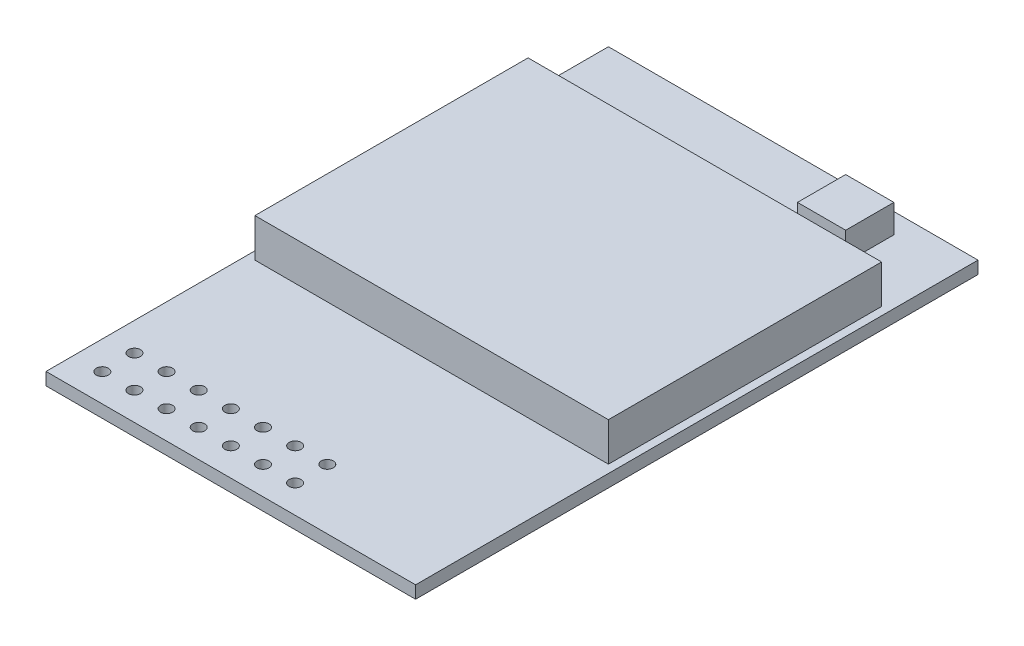
ISO-10303-21;
HEADER;
FILE_DESCRIPTION(('STEP AP214'),'2;1');
FILE_NAME('part.step','',(''),(''),'','','');
FILE_SCHEMA(('AUTOMOTIVE_DESIGN { 1 0 10303 214 1 1 1 1 }'));
ENDSEC;
DATA;
#1=APPLICATION_CONTEXT('core data for automotive mechanical design processes');
#2=APPLICATION_PROTOCOL_DEFINITION('international standard','automotive_design',2000,#1);
#3=PRODUCT_CONTEXT('',#1,'mechanical');
#4=PRODUCT('Part','Part','',(#3));
#5=PRODUCT_RELATED_PRODUCT_CATEGORY('part','',(#4));
#6=PRODUCT_DEFINITION_FORMATION('','',#4);
#7=PRODUCT_DEFINITION_CONTEXT('part definition',#1,'design');
#8=PRODUCT_DEFINITION('design','',#6,#7);
#9=PRODUCT_DEFINITION_SHAPE('','',#8);
#10=(LENGTH_UNIT() NAMED_UNIT(*) SI_UNIT(.MILLI.,.METRE.));
#11=(NAMED_UNIT(*) PLANE_ANGLE_UNIT() SI_UNIT($,.RADIAN.));
#12=(NAMED_UNIT(*) SI_UNIT($,.STERADIAN.) SOLID_ANGLE_UNIT());
#13=UNCERTAINTY_MEASURE_WITH_UNIT(LENGTH_MEASURE(1.E-05),#10,'distance_accuracy_value','');
#14=(GEOMETRIC_REPRESENTATION_CONTEXT(3) GLOBAL_UNCERTAINTY_ASSIGNED_CONTEXT((#13)) GLOBAL_UNIT_ASSIGNED_CONTEXT((#10,
#11,#12)) REPRESENTATION_CONTEXT('',''));
#15=CARTESIAN_POINT('',(0.,0.,0.));
#16=DIRECTION('',(0.,0.,1.));
#17=DIRECTION('',(1.,0.,0.));
#18=AXIS2_PLACEMENT_3D('',#15,#16,#17);
#19=CARTESIAN_POINT('',(0.,0.78,0.));
#20=DIRECTION('',(0.,-1.,0.));
#21=DIRECTION('',(0.,0.,-1.));
#22=AXIS2_PLACEMENT_3D('',#19,#20,#21);
#23=PLANE('',#22);
#24=CARTESIAN_POINT('',(-5.73693796657849,0.78,13.7591055458466));
#25=DIRECTION('',(0.,1.,0.));
#26=DIRECTION('',(0.,0.,1.));
#27=AXIS2_PLACEMENT_3D('',#24,#25,#26);
#28=CIRCLE('',#27,0.375000000000001);
#29=CARTESIAN_POINT('',(-5.73693796657849,0.78,14.1341055458466));
#30=VERTEX_POINT('',#29);
#31=EDGE_CURVE('E547',#30,#30,#28,.T.);
#32=ORIENTED_EDGE('',*,*,#31,.F.);
#33=EDGE_LOOP('',(#32));
#34=FACE_BOUND('',#33,.T.);
#35=CARTESIAN_POINT('',(-7.73693796657849,0.78,13.7591055458466));
#36=DIRECTION('',(0.,1.,0.));
#37=DIRECTION('',(0.,0.,1.));
#38=AXIS2_PLACEMENT_3D('',#35,#36,#37);
#39=CIRCLE('',#38,0.375000000000001);
#40=CARTESIAN_POINT('',(-7.73693796657849,0.78,14.1341055458466));
#41=VERTEX_POINT('',#40);
#42=EDGE_CURVE('E553',#41,#41,#39,.T.);
#43=ORIENTED_EDGE('',*,*,#42,.F.);
#44=EDGE_LOOP('',(#43));
#45=FACE_BOUND('',#44,.T.);
#46=CARTESIAN_POINT('',(2.26306203342152,0.78,15.7591055458466));
#47=DIRECTION('',(0.,1.,0.));
#48=DIRECTION('',(0.,0.,1.));
#49=AXIS2_PLACEMENT_3D('',#46,#47,#48);
#50=CIRCLE('',#49,0.375000000000001);
#51=CARTESIAN_POINT('',(2.26306203342152,0.78,16.1341055458466));
#52=VERTEX_POINT('',#51);
#53=EDGE_CURVE('E630',#52,#52,#50,.T.);
#54=ORIENTED_EDGE('',*,*,#53,.F.);
#55=EDGE_LOOP('',(#54));
#56=FACE_BOUND('',#55,.T.);
#57=CARTESIAN_POINT('',(0.263062033421519,0.78,15.7591055458466));
#58=DIRECTION('',(0.,1.,0.));
#59=DIRECTION('',(0.,0.,1.));
#60=AXIS2_PLACEMENT_3D('',#57,#58,#59);
#61=CIRCLE('',#60,0.375000000000001);
#62=CARTESIAN_POINT('',(0.263062033421519,0.78,16.1341055458466));
#63=VERTEX_POINT('',#62);
#64=EDGE_CURVE('E622',#63,#63,#61,.T.);
#65=ORIENTED_EDGE('',*,*,#64,.F.);
#66=EDGE_LOOP('',(#65));
#67=FACE_BOUND('',#66,.T.);
#68=CARTESIAN_POINT('',(-1.73693796657848,0.78,15.7591055458466));
#69=DIRECTION('',(0.,1.,0.));
#70=DIRECTION('',(0.,0.,1.));
#71=AXIS2_PLACEMENT_3D('',#68,#69,#70);
#72=CIRCLE('',#71,0.375000000000001);
#73=CARTESIAN_POINT('',(-1.73693796657848,0.78,16.1341055458466));
#74=VERTEX_POINT('',#73);
#75=EDGE_CURVE('E589',#74,#74,#72,.T.);
#76=ORIENTED_EDGE('',*,*,#75,.F.);
#77=EDGE_LOOP('',(#76));
#78=FACE_BOUND('',#77,.T.);
#79=CARTESIAN_POINT('',(-3.73693796657848,0.78,15.7591055458466));
#80=DIRECTION('',(0.,1.,0.));
#81=DIRECTION('',(0.,0.,1.));
#82=AXIS2_PLACEMENT_3D('',#79,#80,#81);
#83=CIRCLE('',#82,0.375000000000001);
#84=CARTESIAN_POINT('',(-3.73693796657848,0.78,16.1341055458466));
#85=VERTEX_POINT('',#84);
#86=EDGE_CURVE('E581',#85,#85,#83,.T.);
#87=ORIENTED_EDGE('',*,*,#86,.F.);
#88=EDGE_LOOP('',(#87));
#89=FACE_BOUND('',#88,.T.);
#90=CARTESIAN_POINT('',(-5.73693796657848,0.78,15.7591055458466));
#91=DIRECTION('',(0.,1.,0.));
#92=DIRECTION('',(0.,0.,1.));
#93=AXIS2_PLACEMENT_3D('',#90,#91,#92);
#94=CIRCLE('',#93,0.375000000000001);
#95=CARTESIAN_POINT('',(-5.73693796657848,0.78,16.1341055458466));
#96=VERTEX_POINT('',#95);
#97=EDGE_CURVE('E573',#96,#96,#94,.T.);
#98=ORIENTED_EDGE('',*,*,#97,.F.);
#99=EDGE_LOOP('',(#98));
#100=FACE_BOUND('',#99,.T.);
#101=CARTESIAN_POINT('',(-7.73693796657848,0.78,15.7591055458466));
#102=DIRECTION('',(0.,1.,0.));
#103=DIRECTION('',(0.,0.,1.));
#104=AXIS2_PLACEMENT_3D('',#101,#102,#103);
#105=CIRCLE('',#104,0.375000000000001);
#106=CARTESIAN_POINT('',(-7.73693796657848,0.78,16.1341055458466));
#107=VERTEX_POINT('',#106);
#108=EDGE_CURVE('E565',#107,#107,#105,.T.);
#109=ORIENTED_EDGE('',*,*,#108,.F.);
#110=EDGE_LOOP('',(#109));
#111=FACE_BOUND('',#110,.T.);
#112=CARTESIAN_POINT('',(-3.73693796657849,0.78,13.7591055458466));
#113=DIRECTION('',(0.,1.,0.));
#114=DIRECTION('',(0.,0.,1.));
#115=AXIS2_PLACEMENT_3D('',#112,#113,#114);
#116=CIRCLE('',#115,0.375000000000001);
#117=CARTESIAN_POINT('',(-3.73693796657849,0.78,14.1341055458466));
#118=VERTEX_POINT('',#117);
#119=EDGE_CURVE('E556',#118,#118,#116,.T.);
#120=ORIENTED_EDGE('',*,*,#119,.F.);
#121=EDGE_LOOP('',(#120));
#122=FACE_BOUND('',#121,.T.);
#123=CARTESIAN_POINT('',(-1.73693796657849,0.78,13.7591055458466));
#124=DIRECTION('',(0.,1.,0.));
#125=DIRECTION('',(0.,0.,1.));
#126=AXIS2_PLACEMENT_3D('',#123,#124,#125);
#127=CIRCLE('',#126,0.375000000000001);
#128=CARTESIAN_POINT('',(-1.73693796657849,0.78,14.1341055458466));
#129=VERTEX_POINT('',#128);
#130=EDGE_CURVE('E667',#129,#129,#127,.T.);
#131=ORIENTED_EDGE('',*,*,#130,.F.);
#132=EDGE_LOOP('',(#131));
#133=FACE_BOUND('',#132,.T.);
#134=CARTESIAN_POINT('',(0.263062033421512,0.78,13.7591055458466));
#135=DIRECTION('',(0.,1.,0.));
#136=DIRECTION('',(0.,0.,1.));
#137=AXIS2_PLACEMENT_3D('',#134,#135,#136);
#138=CIRCLE('',#137,0.375000000000001);
#139=CARTESIAN_POINT('',(0.263062033421512,0.78,14.1341055458466));
#140=VERTEX_POINT('',#139);
#141=EDGE_CURVE('E659',#140,#140,#138,.T.);
#142=ORIENTED_EDGE('',*,*,#141,.F.);
#143=EDGE_LOOP('',(#142));
#144=FACE_BOUND('',#143,.T.);
#145=CARTESIAN_POINT('',(2.26306203342151,0.78,13.7591055458466));
#146=DIRECTION('',(0.,1.,0.));
#147=DIRECTION('',(0.,0.,1.));
#148=AXIS2_PLACEMENT_3D('',#145,#146,#147);
#149=CIRCLE('',#148,0.375000000000001);
#150=CARTESIAN_POINT('',(2.26306203342151,0.78,14.1341055458466));
#151=VERTEX_POINT('',#150);
#152=EDGE_CURVE('E651',#151,#151,#149,.T.);
#153=ORIENTED_EDGE('',*,*,#152,.F.);
#154=EDGE_LOOP('',(#153));
#155=FACE_BOUND('',#154,.T.);
#156=CARTESIAN_POINT('',(-9.73693796657849,0.78,13.7591055458466));
#157=DIRECTION('',(0.,1.,0.));
#158=DIRECTION('',(0.,0.,1.));
#159=AXIS2_PLACEMENT_3D('',#156,#157,#158);
#160=CIRCLE('',#159,0.375000000000001);
#161=CARTESIAN_POINT('',(-9.73693796657849,0.78,14.1341055458466));
#162=VERTEX_POINT('',#161);
#163=EDGE_CURVE('E643',#162,#162,#160,.T.);
#164=ORIENTED_EDGE('',*,*,#163,.F.);
#165=EDGE_LOOP('',(#164));
#166=FACE_BOUND('',#165,.T.);
#167=CARTESIAN_POINT('',(-9.73693796657848,0.78,15.7591055458466));
#168=DIRECTION('',(0.,1.,0.));
#169=DIRECTION('',(0.,0.,1.));
#170=AXIS2_PLACEMENT_3D('',#167,#168,#169);
#171=CIRCLE('',#170,0.375000000000001);
#172=CARTESIAN_POINT('',(-9.73693796657848,0.78,16.1341055458466));
#173=VERTEX_POINT('',#172);
#174=EDGE_CURVE('E564',#173,#173,#171,.T.);
#175=ORIENTED_EDGE('',*,*,#174,.F.);
#176=EDGE_LOOP('',(#175));
#177=FACE_BOUND('',#176,.T.);
#178=DIRECTION('',(0.,0.,-1.));
#179=VECTOR('',#178,1.);
#180=CARTESIAN_POINT('',(11.,0.78,-12.));
#181=LINE('',#180,#179);
#182=CARTESIAN_POINT('',(11.,0.78,5.));
#183=VERTEX_POINT('',#182);
#184=CARTESIAN_POINT('',(11.,0.78,-12.));
#185=VERTEX_POINT('',#184);
#186=EDGE_CURVE('E152',#183,#185,#181,.T.);
#187=ORIENTED_EDGE('',*,*,#186,.F.);
#188=DIRECTION('',(1.,0.,0.));
#189=VECTOR('',#188,1.);
#190=CARTESIAN_POINT('',(-11.,0.78,5.));
#191=LINE('',#190,#189);
#192=CARTESIAN_POINT('',(-11.,0.78,5.));
#193=VERTEX_POINT('',#192);
#194=EDGE_CURVE('E168',#193,#183,#191,.T.);
#195=ORIENTED_EDGE('',*,*,#194,.F.);
#196=DIRECTION('',(0.,0.,1.));
#197=VECTOR('',#196,1.);
#198=CARTESIAN_POINT('',(-11.,0.78,-12.));
#199=LINE('',#198,#197);
#200=CARTESIAN_POINT('',(-11.,0.78,-12.));
#201=VERTEX_POINT('',#200);
#202=EDGE_CURVE('E181',#201,#193,#199,.T.);
#203=ORIENTED_EDGE('',*,*,#202,.F.);
#204=DIRECTION('',(-1.,0.,0.));
#205=VECTOR('',#204,1.);
#206=CARTESIAN_POINT('',(-11.,0.78,-12.));
#207=LINE('',#206,#205);
#208=EDGE_CURVE('E157',#185,#201,#207,.T.);
#209=ORIENTED_EDGE('',*,*,#208,.F.);
#210=EDGE_LOOP('',(#187,#195,#203,#209));
#211=FACE_BOUND('',#210,.T.);
#212=DIRECTION('',(0.,0.,-1.));
#213=VECTOR('',#212,1.);
#214=CARTESIAN_POINT('',(11.5,0.78,17.5));
#215=LINE('',#214,#213);
#216=CARTESIAN_POINT('',(11.5,0.78,17.5));
#217=VERTEX_POINT('',#216);
#218=CARTESIAN_POINT('',(11.5,0.78,-17.5));
#219=VERTEX_POINT('',#218);
#220=EDGE_CURVE('E204',#217,#219,#215,.T.);
#221=ORIENTED_EDGE('',*,*,#220,.T.);
#222=DIRECTION('',(-1.,0.,0.));
#223=VECTOR('',#222,1.);
#224=CARTESIAN_POINT('',(-11.5,0.78,-17.5));
#225=LINE('',#224,#223);
#226=CARTESIAN_POINT('',(-11.5,0.78,-17.5));
#227=VERTEX_POINT('',#226);
#228=EDGE_CURVE('E208',#219,#227,#225,.T.);
#229=ORIENTED_EDGE('',*,*,#228,.T.);
#230=DIRECTION('',(0.,0.,1.));
#231=VECTOR('',#230,1.);
#232=CARTESIAN_POINT('',(-11.5,0.78,17.5));
#233=LINE('',#232,#231);
#234=CARTESIAN_POINT('',(-11.5,0.78,17.5));
#235=VERTEX_POINT('',#234);
#236=EDGE_CURVE('E212',#227,#235,#233,.T.);
#237=ORIENTED_EDGE('',*,*,#236,.T.);
#238=DIRECTION('',(1.,0.,0.));
#239=VECTOR('',#238,1.);
#240=CARTESIAN_POINT('',(-11.5,0.78,17.5));
#241=LINE('',#240,#239);
#242=EDGE_CURVE('E215',#235,#217,#241,.T.);
#243=ORIENTED_EDGE('',*,*,#242,.T.);
#244=EDGE_LOOP('',(#221,#229,#237,#243));
#245=FACE_BOUND('',#244,.T.);
#246=DIRECTION('',(0.,0.,-1.));
#247=VECTOR('',#246,1.);
#248=CARTESIAN_POINT('',(7.52134132497843,0.78,-16.2441492984607));
#249=LINE('',#248,#247);
#250=CARTESIAN_POINT('',(7.52134132497843,0.78,-13.2441492984607));
#251=VERTEX_POINT('',#250);
#252=CARTESIAN_POINT('',(7.52134132497843,0.78,-16.2441492984607));
#253=VERTEX_POINT('',#252);
#254=EDGE_CURVE('E150',#251,#253,#249,.T.);
#255=ORIENTED_EDGE('',*,*,#254,.F.);
#256=DIRECTION('',(1.,0.,0.));
#257=VECTOR('',#256,1.);
#258=CARTESIAN_POINT('',(4.52134132497843,0.78,-13.2441492984607));
#259=LINE('',#258,#257);
#260=CARTESIAN_POINT('',(4.52134132497843,0.78,-13.2441492984607));
#261=VERTEX_POINT('',#260);
#262=EDGE_CURVE('E147',#261,#251,#259,.T.);
#263=ORIENTED_EDGE('',*,*,#262,.F.);
#264=DIRECTION('',(0.,0.,1.));
#265=VECTOR('',#264,1.);
#266=CARTESIAN_POINT('',(4.52134132497843,0.78,-16.2441492984607));
#267=LINE('',#266,#265);
#268=CARTESIAN_POINT('',(4.52134132497843,0.78,-16.2441492984607));
#269=VERTEX_POINT('',#268);
#270=EDGE_CURVE('E59',#269,#261,#267,.T.);
#271=ORIENTED_EDGE('',*,*,#270,.F.);
#272=DIRECTION('',(-1.,0.,0.));
#273=VECTOR('',#272,1.);
#274=CARTESIAN_POINT('',(4.52134132497843,0.78,-16.2441492984607));
#275=LINE('',#274,#273);
#276=EDGE_CURVE('E54',#253,#269,#275,.T.);
#277=ORIENTED_EDGE('',*,*,#276,.F.);
#278=EDGE_LOOP('',(#255,#263,#271,#277));
#279=FACE_BOUND('',#278,.T.);
#280=ADVANCED_FACE('F38',(#34,#45,#56,#67,#78,#89,#100,#111,#122,#133,#144,#155,#166,#177,#211,
#245,#279),#23,.F.);
#281=CARTESIAN_POINT('',(11.5,0.78,17.5));
#282=DIRECTION('',(-1.,0.,0.));
#283=DIRECTION('',(0.,0.,1.));
#284=AXIS2_PLACEMENT_3D('',#281,#282,#283);
#285=PLANE('',#284);
#286=DIRECTION('',(0.,0.,-1.));
#287=VECTOR('',#286,1.);
#288=CARTESIAN_POINT('',(11.5,0.,17.5));
#289=LINE('',#288,#287);
#290=CARTESIAN_POINT('',(11.5,0.,17.5));
#291=VERTEX_POINT('',#290);
#292=CARTESIAN_POINT('',(11.5,0.,-17.5));
#293=VERTEX_POINT('',#292);
#294=EDGE_CURVE('E203',#291,#293,#289,.T.);
#295=ORIENTED_EDGE('',*,*,#294,.T.);
#296=DIRECTION('',(0.,-1.,0.));
#297=VECTOR('',#296,1.);
#298=CARTESIAN_POINT('',(11.5,0.78,-17.5));
#299=LINE('',#298,#297);
#300=EDGE_CURVE('E11',#219,#293,#299,.T.);
#301=ORIENTED_EDGE('',*,*,#300,.F.);
#302=ORIENTED_EDGE('',*,*,#220,.F.);
#303=DIRECTION('',(0.,-1.,0.));
#304=VECTOR('',#303,1.);
#305=CARTESIAN_POINT('',(11.5,0.78,17.5));
#306=LINE('',#305,#304);
#307=EDGE_CURVE('E218',#217,#291,#306,.T.);
#308=ORIENTED_EDGE('',*,*,#307,.T.);
#309=EDGE_LOOP('',(#295,#301,#302,#308));
#310=FACE_BOUND('',#309,.T.);
#311=ADVANCED_FACE('F40',(#310),#285,.F.);
#312=CARTESIAN_POINT('',(-11.5,0.78,-17.5));
#313=DIRECTION('',(0.,0.,1.));
#314=DIRECTION('',(1.,0.,0.));
#315=AXIS2_PLACEMENT_3D('',#312,#313,#314);
#316=PLANE('',#315);
#317=DIRECTION('',(-1.,0.,0.));
#318=VECTOR('',#317,1.);
#319=CARTESIAN_POINT('',(-11.5,0.,-17.5));
#320=LINE('',#319,#318);
#321=CARTESIAN_POINT('',(-11.5,0.,-17.5));
#322=VERTEX_POINT('',#321);
#323=EDGE_CURVE('E222',#293,#322,#320,.T.);
#324=ORIENTED_EDGE('',*,*,#323,.T.);
#325=DIRECTION('',(0.,-1.,0.));
#326=VECTOR('',#325,1.);
#327=CARTESIAN_POINT('',(-11.5,0.78,-17.5));
#328=LINE('',#327,#326);
#329=EDGE_CURVE('E47',#227,#322,#328,.T.);
#330=ORIENTED_EDGE('',*,*,#329,.F.);
#331=ORIENTED_EDGE('',*,*,#228,.F.);
#332=ORIENTED_EDGE('',*,*,#300,.T.);
#333=EDGE_LOOP('',(#324,#330,#331,#332));
#334=FACE_BOUND('',#333,.T.);
#335=ADVANCED_FACE('F257',(#334),#316,.F.);
#336=CARTESIAN_POINT('',(-11.5,0.78,17.5));
#337=DIRECTION('',(1.,0.,0.));
#338=DIRECTION('',(0.,0.,-1.));
#339=AXIS2_PLACEMENT_3D('',#336,#337,#338);
#340=PLANE('',#339);
#341=DIRECTION('',(0.,0.,1.));
#342=VECTOR('',#341,1.);
#343=CARTESIAN_POINT('',(-11.5,0.,17.5));
#344=LINE('',#343,#342);
#345=CARTESIAN_POINT('',(-11.5,0.,17.5));
#346=VERTEX_POINT('',#345);
#347=EDGE_CURVE('E225',#322,#346,#344,.T.);
#348=ORIENTED_EDGE('',*,*,#347,.T.);
#349=DIRECTION('',(0.,-1.,0.));
#350=VECTOR('',#349,1.);
#351=CARTESIAN_POINT('',(-11.5,0.78,17.5));
#352=LINE('',#351,#350);
#353=EDGE_CURVE('E233',#235,#346,#352,.T.);
#354=ORIENTED_EDGE('',*,*,#353,.F.);
#355=ORIENTED_EDGE('',*,*,#236,.F.);
#356=ORIENTED_EDGE('',*,*,#329,.T.);
#357=EDGE_LOOP('',(#348,#354,#355,#356));
#358=FACE_BOUND('',#357,.T.);
#359=ADVANCED_FACE('F242',(#358),#340,.F.);
#360=CARTESIAN_POINT('',(-11.5,0.78,17.5));
#361=DIRECTION('',(0.,0.,-1.));
#362=DIRECTION('',(-1.,0.,0.));
#363=AXIS2_PLACEMENT_3D('',#360,#361,#362);
#364=PLANE('',#363);
#365=DIRECTION('',(1.,0.,0.));
#366=VECTOR('',#365,1.);
#367=CARTESIAN_POINT('',(-11.5,0.,17.5));
#368=LINE('',#367,#366);
#369=EDGE_CURVE('E209',#346,#291,#368,.T.);
#370=ORIENTED_EDGE('',*,*,#369,.T.);
#371=ORIENTED_EDGE('',*,*,#307,.F.);
#372=ORIENTED_EDGE('',*,*,#242,.F.);
#373=ORIENTED_EDGE('',*,*,#353,.T.);
#374=EDGE_LOOP('',(#370,#371,#372,#373));
#375=FACE_BOUND('',#374,.T.);
#376=ADVANCED_FACE('F251',(#375),#364,.F.);
#377=CARTESIAN_POINT('',(0.,0.,0.));
#378=DIRECTION('',(0.,-1.,0.));
#379=DIRECTION('',(0.,0.,-1.));
#380=AXIS2_PLACEMENT_3D('',#377,#378,#379);
#381=PLANE('',#380);
#382=CARTESIAN_POINT('',(-5.73693796657849,0.,13.7591055458466));
#383=DIRECTION('',(0.,1.,0.));
#384=DIRECTION('',(0.,0.,1.));
#385=AXIS2_PLACEMENT_3D('',#382,#383,#384);
#386=CIRCLE('',#385,0.375000000000001);
#387=CARTESIAN_POINT('',(-5.73693796657849,0.,14.1341055458466));
#388=VERTEX_POINT('',#387);
#389=EDGE_CURVE('E545',#388,#388,#386,.T.);
#390=ORIENTED_EDGE('',*,*,#389,.T.);
#391=EDGE_LOOP('',(#390));
#392=FACE_BOUND('',#391,.T.);
#393=CARTESIAN_POINT('',(-7.73693796657849,0.,13.7591055458466));
#394=DIRECTION('',(0.,1.,0.));
#395=DIRECTION('',(0.,0.,1.));
#396=AXIS2_PLACEMENT_3D('',#393,#394,#395);
#397=CIRCLE('',#396,0.375000000000001);
#398=CARTESIAN_POINT('',(-7.73693796657849,0.,14.1341055458466));
#399=VERTEX_POINT('',#398);
#400=EDGE_CURVE('E634',#399,#399,#397,.T.);
#401=ORIENTED_EDGE('',*,*,#400,.T.);
#402=EDGE_LOOP('',(#401));
#403=FACE_BOUND('',#402,.T.);
#404=CARTESIAN_POINT('',(2.26306203342152,0.,15.7591055458466));
#405=DIRECTION('',(0.,1.,0.));
#406=DIRECTION('',(0.,0.,1.));
#407=AXIS2_PLACEMENT_3D('',#404,#405,#406);
#408=CIRCLE('',#407,0.375000000000001);
#409=CARTESIAN_POINT('',(2.26306203342152,0.,16.1341055458466));
#410=VERTEX_POINT('',#409);
#411=EDGE_CURVE('E626',#410,#410,#408,.T.);
#412=ORIENTED_EDGE('',*,*,#411,.T.);
#413=EDGE_LOOP('',(#412));
#414=FACE_BOUND('',#413,.T.);
#415=CARTESIAN_POINT('',(0.263062033421519,0.,15.7591055458466));
#416=DIRECTION('',(0.,1.,0.));
#417=DIRECTION('',(0.,0.,1.));
#418=AXIS2_PLACEMENT_3D('',#415,#416,#417);
#419=CIRCLE('',#418,0.375000000000001);
#420=CARTESIAN_POINT('',(0.263062033421519,0.,16.1341055458466));
#421=VERTEX_POINT('',#420);
#422=EDGE_CURVE('E593',#421,#421,#419,.T.);
#423=ORIENTED_EDGE('',*,*,#422,.T.);
#424=EDGE_LOOP('',(#423));
#425=FACE_BOUND('',#424,.T.);
#426=CARTESIAN_POINT('',(-1.73693796657848,0.,15.7591055458466));
#427=DIRECTION('',(0.,1.,0.));
#428=DIRECTION('',(0.,0.,1.));
#429=AXIS2_PLACEMENT_3D('',#426,#427,#428);
#430=CIRCLE('',#429,0.375000000000001);
#431=CARTESIAN_POINT('',(-1.73693796657848,0.,16.1341055458466));
#432=VERTEX_POINT('',#431);
#433=EDGE_CURVE('E585',#432,#432,#430,.T.);
#434=ORIENTED_EDGE('',*,*,#433,.T.);
#435=EDGE_LOOP('',(#434));
#436=FACE_BOUND('',#435,.T.);
#437=CARTESIAN_POINT('',(-3.73693796657848,0.,15.7591055458466));
#438=DIRECTION('',(0.,1.,0.));
#439=DIRECTION('',(0.,0.,1.));
#440=AXIS2_PLACEMENT_3D('',#437,#438,#439);
#441=CIRCLE('',#440,0.375000000000001);
#442=CARTESIAN_POINT('',(-3.73693796657848,0.,16.1341055458466));
#443=VERTEX_POINT('',#442);
#444=EDGE_CURVE('E577',#443,#443,#441,.T.);
#445=ORIENTED_EDGE('',*,*,#444,.T.);
#446=EDGE_LOOP('',(#445));
#447=FACE_BOUND('',#446,.T.);
#448=CARTESIAN_POINT('',(-5.73693796657848,0.,15.7591055458466));
#449=DIRECTION('',(0.,1.,0.));
#450=DIRECTION('',(0.,0.,1.));
#451=AXIS2_PLACEMENT_3D('',#448,#449,#450);
#452=CIRCLE('',#451,0.375000000000001);
#453=CARTESIAN_POINT('',(-5.73693796657848,0.,16.1341055458466));
#454=VERTEX_POINT('',#453);
#455=EDGE_CURVE('E569',#454,#454,#452,.T.);
#456=ORIENTED_EDGE('',*,*,#455,.T.);
#457=EDGE_LOOP('',(#456));
#458=FACE_BOUND('',#457,.T.);
#459=CARTESIAN_POINT('',(-7.73693796657848,0.,15.7591055458466));
#460=DIRECTION('',(0.,1.,0.));
#461=DIRECTION('',(0.,0.,1.));
#462=AXIS2_PLACEMENT_3D('',#459,#460,#461);
#463=CIRCLE('',#462,0.375000000000001);
#464=CARTESIAN_POINT('',(-7.73693796657848,0.,16.1341055458466));
#465=VERTEX_POINT('',#464);
#466=EDGE_CURVE('E560',#465,#465,#463,.T.);
#467=ORIENTED_EDGE('',*,*,#466,.T.);
#468=EDGE_LOOP('',(#467));
#469=FACE_BOUND('',#468,.T.);
#470=CARTESIAN_POINT('',(-3.73693796657849,0.,13.7591055458466));
#471=DIRECTION('',(0.,1.,0.));
#472=DIRECTION('',(0.,0.,1.));
#473=AXIS2_PLACEMENT_3D('',#470,#471,#472);
#474=CIRCLE('',#473,0.375000000000001);
#475=CARTESIAN_POINT('',(-3.73693796657849,0.,14.1341055458466));
#476=VERTEX_POINT('',#475);
#477=EDGE_CURVE('E549',#476,#476,#474,.T.);
#478=ORIENTED_EDGE('',*,*,#477,.T.);
#479=EDGE_LOOP('',(#478));
#480=FACE_BOUND('',#479,.T.);
#481=CARTESIAN_POINT('',(-1.73693796657849,0.,13.7591055458466));
#482=DIRECTION('',(0.,1.,0.));
#483=DIRECTION('',(0.,0.,1.));
#484=AXIS2_PLACEMENT_3D('',#481,#482,#483);
#485=CIRCLE('',#484,0.375000000000001);
#486=CARTESIAN_POINT('',(-1.73693796657849,0.,14.1341055458466));
#487=VERTEX_POINT('',#486);
#488=EDGE_CURVE('E671',#487,#487,#485,.T.);
#489=ORIENTED_EDGE('',*,*,#488,.T.);
#490=EDGE_LOOP('',(#489));
#491=FACE_BOUND('',#490,.T.);
#492=CARTESIAN_POINT('',(0.263062033421512,0.,13.7591055458466));
#493=DIRECTION('',(0.,1.,0.));
#494=DIRECTION('',(0.,0.,1.));
#495=AXIS2_PLACEMENT_3D('',#492,#493,#494);
#496=CIRCLE('',#495,0.375000000000001);
#497=CARTESIAN_POINT('',(0.263062033421512,0.,14.1341055458466));
#498=VERTEX_POINT('',#497);
#499=EDGE_CURVE('E663',#498,#498,#496,.T.);
#500=ORIENTED_EDGE('',*,*,#499,.T.);
#501=EDGE_LOOP('',(#500));
#502=FACE_BOUND('',#501,.T.);
#503=CARTESIAN_POINT('',(2.26306203342151,0.,13.7591055458466));
#504=DIRECTION('',(0.,1.,0.));
#505=DIRECTION('',(0.,0.,1.));
#506=AXIS2_PLACEMENT_3D('',#503,#504,#505);
#507=CIRCLE('',#506,0.375000000000001);
#508=CARTESIAN_POINT('',(2.26306203342151,0.,14.1341055458466));
#509=VERTEX_POINT('',#508);
#510=EDGE_CURVE('E655',#509,#509,#507,.T.);
#511=ORIENTED_EDGE('',*,*,#510,.T.);
#512=EDGE_LOOP('',(#511));
#513=FACE_BOUND('',#512,.T.);
#514=CARTESIAN_POINT('',(-9.73693796657849,0.,13.7591055458466));
#515=DIRECTION('',(0.,1.,0.));
#516=DIRECTION('',(0.,0.,1.));
#517=AXIS2_PLACEMENT_3D('',#514,#515,#516);
#518=CIRCLE('',#517,0.375000000000001);
#519=CARTESIAN_POINT('',(-9.73693796657849,0.,14.1341055458466));
#520=VERTEX_POINT('',#519);
#521=EDGE_CURVE('E647',#520,#520,#518,.T.);
#522=ORIENTED_EDGE('',*,*,#521,.T.);
#523=EDGE_LOOP('',(#522));
#524=FACE_BOUND('',#523,.T.);
#525=CARTESIAN_POINT('',(-9.73693796657848,0.,15.7591055458466));
#526=DIRECTION('',(0.,1.,0.));
#527=DIRECTION('',(0.,0.,1.));
#528=AXIS2_PLACEMENT_3D('',#525,#526,#527);
#529=CIRCLE('',#528,0.375000000000001);
#530=CARTESIAN_POINT('',(-9.73693796657848,0.,16.1341055458466));
#531=VERTEX_POINT('',#530);
#532=EDGE_CURVE('E594',#531,#531,#529,.T.);
#533=ORIENTED_EDGE('',*,*,#532,.T.);
#534=EDGE_LOOP('',(#533));
#535=FACE_BOUND('',#534,.T.);
#536=ORIENTED_EDGE('',*,*,#294,.F.);
#537=ORIENTED_EDGE('',*,*,#369,.F.);
#538=ORIENTED_EDGE('',*,*,#347,.F.);
#539=ORIENTED_EDGE('',*,*,#323,.F.);
#540=EDGE_LOOP('',(#536,#537,#538,#539));
#541=FACE_BOUND('',#540,.T.);
#542=ADVANCED_FACE('F248',(#392,#403,#414,#425,#436,#447,#458,#469,#480,#491,#502,#513,#524,
#535,#541),#381,.T.);
#543=CARTESIAN_POINT('',(11.,3.18,-12.));
#544=DIRECTION('',(-1.,0.,0.));
#545=DIRECTION('',(0.,0.,1.));
#546=AXIS2_PLACEMENT_3D('',#543,#544,#545);
#547=PLANE('',#546);
#548=ORIENTED_EDGE('',*,*,#186,.T.);
#549=DIRECTION('',(0.,-1.,0.));
#550=VECTOR('',#549,1.);
#551=CARTESIAN_POINT('',(11.,3.18,-12.));
#552=LINE('',#551,#550);
#553=CARTESIAN_POINT('',(11.,3.18,-12.));
#554=VERTEX_POINT('',#553);
#555=EDGE_CURVE('E199',#554,#185,#552,.T.);
#556=ORIENTED_EDGE('',*,*,#555,.F.);
#557=DIRECTION('',(0.,0.,-1.));
#558=VECTOR('',#557,1.);
#559=CARTESIAN_POINT('',(11.,3.18,-12.));
#560=LINE('',#559,#558);
#561=CARTESIAN_POINT('',(11.,3.18,5.));
#562=VERTEX_POINT('',#561);
#563=EDGE_CURVE('E163',#562,#554,#560,.T.);
#564=ORIENTED_EDGE('',*,*,#563,.F.);
#565=DIRECTION('',(0.,-1.,0.));
#566=VECTOR('',#565,1.);
#567=CARTESIAN_POINT('',(11.,3.18,5.));
#568=LINE('',#567,#566);
#569=EDGE_CURVE('E176',#562,#183,#568,.T.);
#570=ORIENTED_EDGE('',*,*,#569,.T.);
#571=EDGE_LOOP('',(#548,#556,#564,#570));
#572=FACE_BOUND('',#571,.T.);
#573=ADVANCED_FACE('F273',(#572),#547,.F.);
#574=CARTESIAN_POINT('',(-11.,3.18,-12.));
#575=DIRECTION('',(0.,0.,1.));
#576=DIRECTION('',(1.,0.,0.));
#577=AXIS2_PLACEMENT_3D('',#574,#575,#576);
#578=PLANE('',#577);
#579=ORIENTED_EDGE('',*,*,#208,.T.);
#580=DIRECTION('',(0.,-1.,0.));
#581=VECTOR('',#580,1.);
#582=CARTESIAN_POINT('',(-11.,3.18,-12.));
#583=LINE('',#582,#581);
#584=CARTESIAN_POINT('',(-11.,3.18,-12.));
#585=VERTEX_POINT('',#584);
#586=EDGE_CURVE('E195',#585,#201,#583,.T.);
#587=ORIENTED_EDGE('',*,*,#586,.F.);
#588=DIRECTION('',(-1.,0.,0.));
#589=VECTOR('',#588,1.);
#590=CARTESIAN_POINT('',(-11.,3.18,-12.));
#591=LINE('',#590,#589);
#592=EDGE_CURVE('E167',#554,#585,#591,.T.);
#593=ORIENTED_EDGE('',*,*,#592,.F.);
#594=ORIENTED_EDGE('',*,*,#555,.T.);
#595=EDGE_LOOP('',(#579,#587,#593,#594));
#596=FACE_BOUND('',#595,.T.);
#597=ADVANCED_FACE('F294',(#596),#578,.F.);
#598=CARTESIAN_POINT('',(-11.,3.18,-12.));
#599=DIRECTION('',(1.,0.,0.));
#600=DIRECTION('',(0.,0.,-1.));
#601=AXIS2_PLACEMENT_3D('',#598,#599,#600);
#602=PLANE('',#601);
#603=ORIENTED_EDGE('',*,*,#202,.T.);
#604=DIRECTION('',(0.,-1.,0.));
#605=VECTOR('',#604,1.);
#606=CARTESIAN_POINT('',(-11.,3.18,5.));
#607=LINE('',#606,#605);
#608=CARTESIAN_POINT('',(-11.,3.18,5.));
#609=VERTEX_POINT('',#608);
#610=EDGE_CURVE('E191',#609,#193,#607,.T.);
#611=ORIENTED_EDGE('',*,*,#610,.F.);
#612=DIRECTION('',(0.,0.,1.));
#613=VECTOR('',#612,1.);
#614=CARTESIAN_POINT('',(-11.,3.18,-12.));
#615=LINE('',#614,#613);
#616=EDGE_CURVE('E171',#585,#609,#615,.T.);
#617=ORIENTED_EDGE('',*,*,#616,.F.);
#618=ORIENTED_EDGE('',*,*,#586,.T.);
#619=EDGE_LOOP('',(#603,#611,#617,#618));
#620=FACE_BOUND('',#619,.T.);
#621=ADVANCED_FACE('F301',(#620),#602,.F.);
#622=CARTESIAN_POINT('',(-11.,3.18,5.));
#623=DIRECTION('',(0.,0.,-1.));
#624=DIRECTION('',(-1.,0.,0.));
#625=AXIS2_PLACEMENT_3D('',#622,#623,#624);
#626=PLANE('',#625);
#627=ORIENTED_EDGE('',*,*,#194,.T.);
#628=ORIENTED_EDGE('',*,*,#569,.F.);
#629=DIRECTION('',(1.,0.,0.));
#630=VECTOR('',#629,1.);
#631=CARTESIAN_POINT('',(-11.,3.18,5.));
#632=LINE('',#631,#630);
#633=EDGE_CURVE('E174',#609,#562,#632,.T.);
#634=ORIENTED_EDGE('',*,*,#633,.F.);
#635=ORIENTED_EDGE('',*,*,#610,.T.);
#636=EDGE_LOOP('',(#627,#628,#634,#635));
#637=FACE_BOUND('',#636,.T.);
#638=ADVANCED_FACE('F308',(#637),#626,.F.);
#639=CARTESIAN_POINT('',(0.,3.18,0.));
#640=DIRECTION('',(0.,1.,0.));
#641=DIRECTION('',(0.,0.,1.));
#642=AXIS2_PLACEMENT_3D('',#639,#640,#641);
#643=PLANE('',#642);
#644=ORIENTED_EDGE('',*,*,#563,.T.);
#645=ORIENTED_EDGE('',*,*,#592,.T.);
#646=ORIENTED_EDGE('',*,*,#616,.T.);
#647=ORIENTED_EDGE('',*,*,#633,.T.);
#648=EDGE_LOOP('',(#644,#645,#646,#647));
#649=FACE_BOUND('',#648,.T.);
#650=ADVANCED_FACE('F316',(#649),#643,.T.);
#651=CARTESIAN_POINT('',(7.52134132497843,2.53,-16.2441492984607));
#652=DIRECTION('',(-1.,0.,0.));
#653=DIRECTION('',(0.,0.,1.));
#654=AXIS2_PLACEMENT_3D('',#651,#652,#653);
#655=PLANE('',#654);
#656=ORIENTED_EDGE('',*,*,#254,.T.);
#657=DIRECTION('',(0.,-1.,0.));
#658=VECTOR('',#657,1.);
#659=CARTESIAN_POINT('',(7.52134132497843,2.53,-16.2441492984607));
#660=LINE('',#659,#658);
#661=CARTESIAN_POINT('',(7.52134132497843,2.53,-16.2441492984607));
#662=VERTEX_POINT('',#661);
#663=EDGE_CURVE('E129',#662,#253,#660,.T.);
#664=ORIENTED_EDGE('',*,*,#663,.F.);
#665=DIRECTION('',(0.,0.,-1.));
#666=VECTOR('',#665,1.);
#667=CARTESIAN_POINT('',(7.52134132497843,2.53,-16.2441492984607));
#668=LINE('',#667,#666);
#669=CARTESIAN_POINT('',(7.52134132497843,2.53,-13.2441492984607));
#670=VERTEX_POINT('',#669);
#671=EDGE_CURVE('E137',#670,#662,#668,.T.);
#672=ORIENTED_EDGE('',*,*,#671,.F.);
#673=DIRECTION('',(0.,-1.,0.));
#674=VECTOR('',#673,1.);
#675=CARTESIAN_POINT('',(7.52134132497843,2.53,-13.2441492984607));
#676=LINE('',#675,#674);
#677=EDGE_CURVE('E605',#670,#251,#676,.T.);
#678=ORIENTED_EDGE('',*,*,#677,.T.);
#679=EDGE_LOOP('',(#656,#664,#672,#678));
#680=FACE_BOUND('',#679,.T.);
#681=ADVANCED_FACE('F149',(#680),#655,.F.);
#682=CARTESIAN_POINT('',(4.52134132497843,2.53,-16.2441492984607));
#683=DIRECTION('',(0.,0.,1.));
#684=DIRECTION('',(1.,0.,0.));
#685=AXIS2_PLACEMENT_3D('',#682,#683,#684);
#686=PLANE('',#685);
#687=ORIENTED_EDGE('',*,*,#276,.T.);
#688=DIRECTION('',(0.,-1.,0.));
#689=VECTOR('',#688,1.);
#690=CARTESIAN_POINT('',(4.52134132497843,2.53,-16.2441492984607));
#691=LINE('',#690,#689);
#692=CARTESIAN_POINT('',(4.52134132497843,2.53,-16.2441492984607));
#693=VERTEX_POINT('',#692);
#694=EDGE_CURVE('E132',#693,#269,#691,.T.);
#695=ORIENTED_EDGE('',*,*,#694,.F.);
#696=DIRECTION('',(-1.,0.,0.));
#697=VECTOR('',#696,1.);
#698=CARTESIAN_POINT('',(4.52134132497843,2.53,-16.2441492984607));
#699=LINE('',#698,#697);
#700=EDGE_CURVE('E125',#662,#693,#699,.T.);
#701=ORIENTED_EDGE('',*,*,#700,.F.);
#702=ORIENTED_EDGE('',*,*,#663,.T.);
#703=EDGE_LOOP('',(#687,#695,#701,#702));
#704=FACE_BOUND('',#703,.T.);
#705=ADVANCED_FACE('F127',(#704),#686,.F.);
#706=CARTESIAN_POINT('',(4.52134132497843,2.53,-16.2441492984607));
#707=DIRECTION('',(1.,0.,0.));
#708=DIRECTION('',(0.,0.,-1.));
#709=AXIS2_PLACEMENT_3D('',#706,#707,#708);
#710=PLANE('',#709);
#711=ORIENTED_EDGE('',*,*,#270,.T.);
#712=DIRECTION('',(0.,-1.,0.));
#713=VECTOR('',#712,1.);
#714=CARTESIAN_POINT('',(4.52134132497843,2.53,-13.2441492984607));
#715=LINE('',#714,#713);
#716=CARTESIAN_POINT('',(4.52134132497843,2.53,-13.2441492984607));
#717=VERTEX_POINT('',#716);
#718=EDGE_CURVE('E159',#717,#261,#715,.T.);
#719=ORIENTED_EDGE('',*,*,#718,.F.);
#720=DIRECTION('',(0.,0.,1.));
#721=VECTOR('',#720,1.);
#722=CARTESIAN_POINT('',(4.52134132497843,2.53,-16.2441492984607));
#723=LINE('',#722,#721);
#724=EDGE_CURVE('E136',#693,#717,#723,.T.);
#725=ORIENTED_EDGE('',*,*,#724,.F.);
#726=ORIENTED_EDGE('',*,*,#694,.T.);
#727=EDGE_LOOP('',(#711,#719,#725,#726));
#728=FACE_BOUND('',#727,.T.);
#729=ADVANCED_FACE('F337',(#728),#710,.F.);
#730=CARTESIAN_POINT('',(4.52134132497843,2.53,-13.2441492984607));
#731=DIRECTION('',(0.,0.,-1.));
#732=DIRECTION('',(-1.,0.,0.));
#733=AXIS2_PLACEMENT_3D('',#730,#731,#732);
#734=PLANE('',#733);
#735=ORIENTED_EDGE('',*,*,#262,.T.);
#736=ORIENTED_EDGE('',*,*,#677,.F.);
#737=DIRECTION('',(1.,0.,0.));
#738=VECTOR('',#737,1.);
#739=CARTESIAN_POINT('',(4.52134132497843,2.53,-13.2441492984607));
#740=LINE('',#739,#738);
#741=EDGE_CURVE('E142',#717,#670,#740,.T.);
#742=ORIENTED_EDGE('',*,*,#741,.F.);
#743=ORIENTED_EDGE('',*,*,#718,.T.);
#744=EDGE_LOOP('',(#735,#736,#742,#743));
#745=FACE_BOUND('',#744,.T.);
#746=ADVANCED_FACE('F344',(#745),#734,.F.);
#747=CARTESIAN_POINT('',(0.,2.53,0.));
#748=DIRECTION('',(0.,1.,0.));
#749=DIRECTION('',(0.,0.,1.));
#750=AXIS2_PLACEMENT_3D('',#747,#748,#749);
#751=PLANE('',#750);
#752=ORIENTED_EDGE('',*,*,#671,.T.);
#753=ORIENTED_EDGE('',*,*,#700,.T.);
#754=ORIENTED_EDGE('',*,*,#724,.T.);
#755=ORIENTED_EDGE('',*,*,#741,.T.);
#756=EDGE_LOOP('',(#752,#753,#754,#755));
#757=FACE_BOUND('',#756,.T.);
#758=ADVANCED_FACE('F140',(#757),#751,.T.);
#759=CARTESIAN_POINT('',(-9.73693796657848,0.,15.7591055458466));
#760=DIRECTION('',(0.,1.,0.));
#761=DIRECTION('',(0.,0.,1.));
#762=AXIS2_PLACEMENT_3D('',#759,#760,#761);
#763=CYLINDRICAL_SURFACE('',#762,0.375000000000001);
#764=ORIENTED_EDGE('',*,*,#532,.F.);
#765=EDGE_LOOP('',(#764));
#766=FACE_BOUND('',#765,.T.);
#767=ORIENTED_EDGE('',*,*,#174,.T.);
#768=EDGE_LOOP('',(#767));
#769=FACE_BOUND('',#768,.T.);
#770=ADVANCED_FACE('F359',(#766,#769),#763,.F.);
#771=CARTESIAN_POINT('',(-9.73693796657849,0.,13.7591055458466));
#772=DIRECTION('',(0.,1.,0.));
#773=DIRECTION('',(0.,0.,1.));
#774=AXIS2_PLACEMENT_3D('',#771,#772,#773);
#775=CYLINDRICAL_SURFACE('',#774,0.375000000000001);
#776=ORIENTED_EDGE('',*,*,#521,.F.);
#777=EDGE_LOOP('',(#776));
#778=FACE_BOUND('',#777,.T.);
#779=ORIENTED_EDGE('',*,*,#163,.T.);
#780=EDGE_LOOP('',(#779));
#781=FACE_BOUND('',#780,.T.);
#782=ADVANCED_FACE('F365',(#778,#781),#775,.F.);
#783=CARTESIAN_POINT('',(2.26306203342151,0.,13.7591055458466));
#784=DIRECTION('',(0.,1.,0.));
#785=DIRECTION('',(0.,0.,1.));
#786=AXIS2_PLACEMENT_3D('',#783,#784,#785);
#787=CYLINDRICAL_SURFACE('',#786,0.375000000000001);
#788=ORIENTED_EDGE('',*,*,#510,.F.);
#789=EDGE_LOOP('',(#788));
#790=FACE_BOUND('',#789,.T.);
#791=ORIENTED_EDGE('',*,*,#152,.T.);
#792=EDGE_LOOP('',(#791));
#793=FACE_BOUND('',#792,.T.);
#794=ADVANCED_FACE('F373',(#790,#793),#787,.F.);
#795=CARTESIAN_POINT('',(0.263062033421512,0.,13.7591055458466));
#796=DIRECTION('',(0.,1.,0.));
#797=DIRECTION('',(0.,0.,1.));
#798=AXIS2_PLACEMENT_3D('',#795,#796,#797);
#799=CYLINDRICAL_SURFACE('',#798,0.375000000000001);
#800=ORIENTED_EDGE('',*,*,#499,.F.);
#801=EDGE_LOOP('',(#800));
#802=FACE_BOUND('',#801,.T.);
#803=ORIENTED_EDGE('',*,*,#141,.T.);
#804=EDGE_LOOP('',(#803));
#805=FACE_BOUND('',#804,.T.);
#806=ADVANCED_FACE('F381',(#802,#805),#799,.F.);
#807=CARTESIAN_POINT('',(-1.73693796657849,0.,13.7591055458466));
#808=DIRECTION('',(0.,1.,0.));
#809=DIRECTION('',(0.,0.,1.));
#810=AXIS2_PLACEMENT_3D('',#807,#808,#809);
#811=CYLINDRICAL_SURFACE('',#810,0.375000000000001);
#812=ORIENTED_EDGE('',*,*,#488,.F.);
#813=EDGE_LOOP('',(#812));
#814=FACE_BOUND('',#813,.T.);
#815=ORIENTED_EDGE('',*,*,#130,.T.);
#816=EDGE_LOOP('',(#815));
#817=FACE_BOUND('',#816,.T.);
#818=ADVANCED_FACE('F389',(#814,#817),#811,.F.);
#819=CARTESIAN_POINT('',(-3.73693796657849,0.,13.7591055458466));
#820=DIRECTION('',(0.,1.,0.));
#821=DIRECTION('',(0.,0.,1.));
#822=AXIS2_PLACEMENT_3D('',#819,#820,#821);
#823=CYLINDRICAL_SURFACE('',#822,0.375000000000001);
#824=ORIENTED_EDGE('',*,*,#477,.F.);
#825=EDGE_LOOP('',(#824));
#826=FACE_BOUND('',#825,.T.);
#827=ORIENTED_EDGE('',*,*,#119,.T.);
#828=EDGE_LOOP('',(#827));
#829=FACE_BOUND('',#828,.T.);
#830=ADVANCED_FACE('F397',(#826,#829),#823,.F.);
#831=CARTESIAN_POINT('',(-7.73693796657848,0.,15.7591055458466));
#832=DIRECTION('',(0.,1.,0.));
#833=DIRECTION('',(0.,0.,1.));
#834=AXIS2_PLACEMENT_3D('',#831,#832,#833);
#835=CYLINDRICAL_SURFACE('',#834,0.375000000000001);
#836=ORIENTED_EDGE('',*,*,#466,.F.);
#837=EDGE_LOOP('',(#836));
#838=FACE_BOUND('',#837,.T.);
#839=ORIENTED_EDGE('',*,*,#108,.T.);
#840=EDGE_LOOP('',(#839));
#841=FACE_BOUND('',#840,.T.);
#842=ADVANCED_FACE('F405',(#838,#841),#835,.F.);
#843=CARTESIAN_POINT('',(-5.73693796657848,0.,15.7591055458466));
#844=DIRECTION('',(0.,1.,0.));
#845=DIRECTION('',(0.,0.,1.));
#846=AXIS2_PLACEMENT_3D('',#843,#844,#845);
#847=CYLINDRICAL_SURFACE('',#846,0.375000000000001);
#848=ORIENTED_EDGE('',*,*,#455,.F.);
#849=EDGE_LOOP('',(#848));
#850=FACE_BOUND('',#849,.T.);
#851=ORIENTED_EDGE('',*,*,#97,.T.);
#852=EDGE_LOOP('',(#851));
#853=FACE_BOUND('',#852,.T.);
#854=ADVANCED_FACE('F413',(#850,#853),#847,.F.);
#855=CARTESIAN_POINT('',(-3.73693796657848,0.,15.7591055458466));
#856=DIRECTION('',(0.,1.,0.));
#857=DIRECTION('',(0.,0.,1.));
#858=AXIS2_PLACEMENT_3D('',#855,#856,#857);
#859=CYLINDRICAL_SURFACE('',#858,0.375000000000001);
#860=ORIENTED_EDGE('',*,*,#444,.F.);
#861=EDGE_LOOP('',(#860));
#862=FACE_BOUND('',#861,.T.);
#863=ORIENTED_EDGE('',*,*,#86,.T.);
#864=EDGE_LOOP('',(#863));
#865=FACE_BOUND('',#864,.T.);
#866=ADVANCED_FACE('F421',(#862,#865),#859,.F.);
#867=CARTESIAN_POINT('',(-1.73693796657848,0.,15.7591055458466));
#868=DIRECTION('',(0.,1.,0.));
#869=DIRECTION('',(0.,0.,1.));
#870=AXIS2_PLACEMENT_3D('',#867,#868,#869);
#871=CYLINDRICAL_SURFACE('',#870,0.375000000000001);
#872=ORIENTED_EDGE('',*,*,#433,.F.);
#873=EDGE_LOOP('',(#872));
#874=FACE_BOUND('',#873,.T.);
#875=ORIENTED_EDGE('',*,*,#75,.T.);
#876=EDGE_LOOP('',(#875));
#877=FACE_BOUND('',#876,.T.);
#878=ADVANCED_FACE('F429',(#874,#877),#871,.F.);
#879=CARTESIAN_POINT('',(0.263062033421519,0.,15.7591055458466));
#880=DIRECTION('',(0.,1.,0.));
#881=DIRECTION('',(0.,0.,1.));
#882=AXIS2_PLACEMENT_3D('',#879,#880,#881);
#883=CYLINDRICAL_SURFACE('',#882,0.375000000000001);
#884=ORIENTED_EDGE('',*,*,#422,.F.);
#885=EDGE_LOOP('',(#884));
#886=FACE_BOUND('',#885,.T.);
#887=ORIENTED_EDGE('',*,*,#64,.T.);
#888=EDGE_LOOP('',(#887));
#889=FACE_BOUND('',#888,.T.);
#890=ADVANCED_FACE('F437',(#886,#889),#883,.F.);
#891=CARTESIAN_POINT('',(2.26306203342152,0.,15.7591055458466));
#892=DIRECTION('',(0.,1.,0.));
#893=DIRECTION('',(0.,0.,1.));
#894=AXIS2_PLACEMENT_3D('',#891,#892,#893);
#895=CYLINDRICAL_SURFACE('',#894,0.375000000000001);
#896=ORIENTED_EDGE('',*,*,#411,.F.);
#897=EDGE_LOOP('',(#896));
#898=FACE_BOUND('',#897,.T.);
#899=ORIENTED_EDGE('',*,*,#53,.T.);
#900=EDGE_LOOP('',(#899));
#901=FACE_BOUND('',#900,.T.);
#902=ADVANCED_FACE('F445',(#898,#901),#895,.F.);
#903=CARTESIAN_POINT('',(-7.73693796657849,0.,13.7591055458466));
#904=DIRECTION('',(0.,1.,0.));
#905=DIRECTION('',(0.,0.,1.));
#906=AXIS2_PLACEMENT_3D('',#903,#904,#905);
#907=CYLINDRICAL_SURFACE('',#906,0.375000000000001);
#908=ORIENTED_EDGE('',*,*,#400,.F.);
#909=EDGE_LOOP('',(#908));
#910=FACE_BOUND('',#909,.T.);
#911=ORIENTED_EDGE('',*,*,#42,.T.);
#912=EDGE_LOOP('',(#911));
#913=FACE_BOUND('',#912,.T.);
#914=ADVANCED_FACE('F453',(#910,#913),#907,.F.);
#915=CARTESIAN_POINT('',(-5.73693796657849,0.,13.7591055458466));
#916=DIRECTION('',(0.,1.,0.));
#917=DIRECTION('',(0.,0.,1.));
#918=AXIS2_PLACEMENT_3D('',#915,#916,#917);
#919=CYLINDRICAL_SURFACE('',#918,0.375000000000001);
#920=ORIENTED_EDGE('',*,*,#389,.F.);
#921=EDGE_LOOP('',(#920));
#922=FACE_BOUND('',#921,.T.);
#923=ORIENTED_EDGE('',*,*,#31,.T.);
#924=EDGE_LOOP('',(#923));
#925=FACE_BOUND('',#924,.T.);
#926=ADVANCED_FACE('F461',(#922,#925),#919,.F.);
#927=CLOSED_SHELL('',(#280,#311,#335,#359,#376,#542,#573,#597,#621,#638,#650,#681,#705,#729,
#746,#758,#770,#782,#794,#806,#818,#830,#842,#854,#866,#878,#890,#902,#914,#926));
#928=MANIFOLD_SOLID_BREP('B2',#927);
#929=ADVANCED_BREP_SHAPE_REPRESENTATION('',(#18,#928),#14);
#930=SHAPE_DEFINITION_REPRESENTATION(#9,#929);
ENDSEC;
END-ISO-10303-21;
